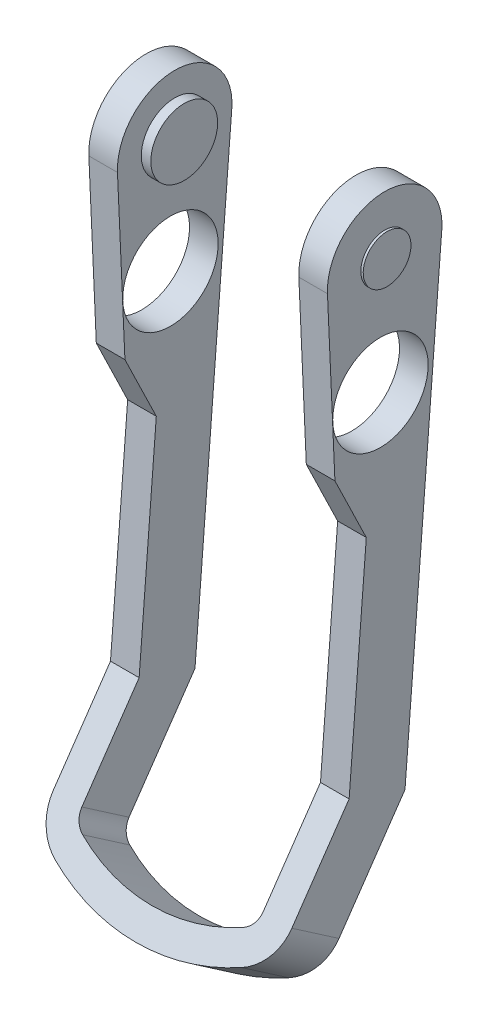
ISO-10303-21;
HEADER;
FILE_DESCRIPTION(('STEP AP214'),'2;1');
FILE_NAME('part.step','',(''),(''),'','','');
FILE_SCHEMA(('AUTOMOTIVE_DESIGN { 1 0 10303 214 1 1 1 1 }'));
ENDSEC;
DATA;
#1=APPLICATION_CONTEXT('core data for automotive mechanical design processes');
#2=APPLICATION_PROTOCOL_DEFINITION('international standard','automotive_design',2000,#1);
#3=PRODUCT_CONTEXT('',#1,'mechanical');
#4=PRODUCT('Part','Part','',(#3));
#5=PRODUCT_RELATED_PRODUCT_CATEGORY('part','',(#4));
#6=PRODUCT_DEFINITION_FORMATION('','',#4);
#7=PRODUCT_DEFINITION_CONTEXT('part definition',#1,'design');
#8=PRODUCT_DEFINITION('design','',#6,#7);
#9=PRODUCT_DEFINITION_SHAPE('','',#8);
#10=(LENGTH_UNIT() NAMED_UNIT(*) SI_UNIT(.MILLI.,.METRE.));
#11=(NAMED_UNIT(*) PLANE_ANGLE_UNIT() SI_UNIT($,.RADIAN.));
#12=(NAMED_UNIT(*) SI_UNIT($,.STERADIAN.) SOLID_ANGLE_UNIT());
#13=UNCERTAINTY_MEASURE_WITH_UNIT(LENGTH_MEASURE(1.E-05),#10,'distance_accuracy_value','');
#14=(GEOMETRIC_REPRESENTATION_CONTEXT(3) GLOBAL_UNCERTAINTY_ASSIGNED_CONTEXT((#13)) GLOBAL_UNIT_ASSIGNED_CONTEXT((#10,
#11,#12)) REPRESENTATION_CONTEXT('',''));
#15=CARTESIAN_POINT('',(0.,0.,0.));
#16=DIRECTION('',(0.,0.,1.));
#17=DIRECTION('',(1.,0.,0.));
#18=AXIS2_PLACEMENT_3D('',#15,#16,#17);
#19=CARTESIAN_POINT('',(8.5,-6.74999999999999,11.25));
#20=DIRECTION('',(-1.,0.,0.));
#21=DIRECTION('',(0.,-1.,0.));
#22=AXIS2_PLACEMENT_3D('',#19,#20,#21);
#23=PLANE('',#22);
#24=CARTESIAN_POINT('',(8.5,-6.74999999999999,11.25));
#25=DIRECTION('',(-1.,0.,0.));
#26=DIRECTION('',(0.,-1.,0.));
#27=AXIS2_PLACEMENT_3D('',#24,#25,#26);
#28=CIRCLE('',#27,3.5);
#29=CARTESIAN_POINT('',(8.5,-10.25,11.25));
#30=VERTEX_POINT('',#29);
#31=EDGE_CURVE('E460',#30,#30,#28,.F.);
#32=ORIENTED_EDGE('',*,*,#31,.F.);
#33=EDGE_LOOP('',(#32));
#34=FACE_BOUND('',#33,.T.);
#35=ADVANCED_FACE('F36',(#34),#23,.T.);
#36=CARTESIAN_POINT('',(-8.50000000000001,-6.74999999999999,11.25));
#37=DIRECTION('',(1.,0.,0.));
#38=DIRECTION('',(0.,1.,0.));
#39=AXIS2_PLACEMENT_3D('',#36,#37,#38);
#40=PLANE('',#39);
#41=CARTESIAN_POINT('',(-8.50000000000001,-6.74999999999999,11.25));
#42=DIRECTION('',(1.,0.,0.));
#43=DIRECTION('',(0.,1.,0.));
#44=AXIS2_PLACEMENT_3D('',#41,#42,#43);
#45=CIRCLE('',#44,3.5);
#46=CARTESIAN_POINT('',(-8.50000000000001,-3.24999999999999,11.25));
#47=VERTEX_POINT('',#46);
#48=EDGE_CURVE('E457',#47,#47,#45,.F.);
#49=ORIENTED_EDGE('',*,*,#48,.F.);
#50=EDGE_LOOP('',(#49));
#51=FACE_BOUND('',#50,.T.);
#52=ADVANCED_FACE('F585',(#51),#40,.T.);
#53=CARTESIAN_POINT('',(9.5,-6.74999999999999,11.25));
#54=DIRECTION('',(-1.,0.,0.));
#55=DIRECTION('',(0.,-1.,0.));
#56=AXIS2_PLACEMENT_3D('',#53,#54,#55);
#57=CYLINDRICAL_SURFACE('',#56,3.5);
#58=ORIENTED_EDGE('',*,*,#31,.T.);
#59=EDGE_LOOP('',(#58));
#60=FACE_BOUND('',#59,.T.);
#61=CARTESIAN_POINT('',(9.5,-6.74999999999999,11.25));
#62=DIRECTION('',(-1.,0.,0.));
#63=DIRECTION('',(0.,-1.,0.));
#64=AXIS2_PLACEMENT_3D('',#61,#62,#63);
#65=CIRCLE('',#64,3.5);
#66=CARTESIAN_POINT('',(9.5,-10.25,11.25));
#67=VERTEX_POINT('',#66);
#68=EDGE_CURVE('E359',#67,#67,#65,.F.);
#69=ORIENTED_EDGE('',*,*,#68,.F.);
#70=EDGE_LOOP('',(#69));
#71=FACE_BOUND('',#70,.T.);
#72=ADVANCED_FACE('F581',(#60,#71),#57,.T.);
#73=CARTESIAN_POINT('',(-9.50000000000001,-6.74999999999999,11.25));
#74=DIRECTION('',(1.,0.,0.));
#75=DIRECTION('',(0.,1.,0.));
#76=AXIS2_PLACEMENT_3D('',#73,#74,#75);
#77=CYLINDRICAL_SURFACE('',#76,3.5);
#78=ORIENTED_EDGE('',*,*,#48,.T.);
#79=EDGE_LOOP('',(#78));
#80=FACE_BOUND('',#79,.T.);
#81=CARTESIAN_POINT('',(-9.50000000000001,-6.74999999999999,11.25));
#82=DIRECTION('',(1.,0.,0.));
#83=DIRECTION('',(0.,1.,0.));
#84=AXIS2_PLACEMENT_3D('',#81,#82,#83);
#85=CIRCLE('',#84,3.5);
#86=CARTESIAN_POINT('',(-9.50000000000001,-3.24999999999999,11.25));
#87=VERTEX_POINT('',#86);
#88=EDGE_CURVE('E363',#87,#87,#85,.F.);
#89=ORIENTED_EDGE('',*,*,#88,.F.);
#90=EDGE_LOOP('',(#89));
#91=FACE_BOUND('',#90,.T.);
#92=ADVANCED_FACE('F577',(#80,#91),#77,.T.);
#93=CARTESIAN_POINT('',(9.50000000000001,-34.9901429155061,12.5355969445364));
#94=DIRECTION('',(-1.,0.,0.));
#95=DIRECTION('',(0.,-1.,0.));
#96=AXIS2_PLACEMENT_3D('',#93,#94,#95);
#97=PLANE('',#96);
#98=CARTESIAN_POINT('',(9.50000000000001,-18.7521667780927,11.6949636286788));
#99=DIRECTION('',(-1.,0.,0.));
#100=DIRECTION('',(0.,-1.,0.));
#101=AXIS2_PLACEMENT_3D('',#98,#99,#100);
#102=CIRCLE('',#101,5.);
#103=CARTESIAN_POINT('',(9.50000000000001,-23.7521667780927,11.6949636286788));
#104=VERTEX_POINT('',#103);
#105=EDGE_CURVE('E463',#104,#104,#102,.F.);
#106=ORIENTED_EDGE('',*,*,#105,.T.);
#107=EDGE_LOOP('',(#106));
#108=FACE_BOUND('',#107,.T.);
#109=ORIENTED_EDGE('',*,*,#68,.T.);
#110=EDGE_LOOP('',(#109));
#111=FACE_BOUND('',#110,.T.);
#112=DIRECTION('',(0.,0.996904814715934,-0.0786180030030606));
#113=VECTOR('',#112,1.);
#114=CARTESIAN_POINT('',(9.5,-56.0700439390991,9.12085325885437));
#115=LINE('',#114,#113);
#116=CARTESIAN_POINT('',(9.5,-56.0700439390991,9.12085325885437));
#117=VERTEX_POINT('',#116);
#118=CARTESIAN_POINT('',(9.50000000000001,-7.22170801801834,5.2685711117044));
#119=VERTEX_POINT('',#118);
#120=EDGE_CURVE('E244',#117,#119,#115,.T.);
#121=ORIENTED_EDGE('',*,*,#120,.F.);
#122=DIRECTION('',(0.,0.824035893197488,-0.566537595153418));
#123=VECTOR('',#122,1.);
#124=CARTESIAN_POINT('',(9.5,-71.7267259098514,19.8850675667693));
#125=LINE('',#124,#123);
#126=CARTESIAN_POINT('',(9.5,-66.12391112171,16.0330445634426));
#127=VERTEX_POINT('',#126);
#128=EDGE_CURVE('E228',#127,#117,#125,.T.);
#129=ORIENTED_EDGE('',*,*,#128,.F.);
#130=DIRECTION('',(0.,-0.566537595153414,-0.824035893197491));
#131=VECTOR('',#130,1.);
#132=CARTESIAN_POINT('',(9.49999999999997,-64.4242983362497,18.505152243035));
#133=LINE('',#132,#131);
#134=CARTESIAN_POINT('',(9.49999999999998,-62.7246855507895,20.9772599226275));
#135=VERTEX_POINT('',#134);
#136=EDGE_CURVE('E356',#135,#127,#133,.T.);
#137=ORIENTED_EDGE('',*,*,#136,.F.);
#138=DIRECTION('',(0.,-0.824035893197488,0.566537595153418));
#139=VECTOR('',#138,1.);
#140=CARTESIAN_POINT('',(9.5,-53.9956168808778,14.9758883646587));
#141=LINE('',#140,#139);
#142=CARTESIAN_POINT('',(9.5,-53.9956168808778,14.9758883646587));
#143=VERTEX_POINT('',#142);
#144=EDGE_CURVE('E282',#143,#135,#141,.T.);
#145=ORIENTED_EDGE('',*,*,#144,.F.);
#146=DIRECTION('',(0.,-0.996904814715934,0.0786180030030609));
#147=VECTOR('',#146,1.);
#148=CARTESIAN_POINT('',(9.50000000000001,-31.1741679605404,13.176141073575));
#149=LINE('',#148,#147);
#150=CARTESIAN_POINT('',(9.50000000000001,-31.1741679605404,13.176141073575));
#151=VERTEX_POINT('',#150);
#152=EDGE_CURVE('E269',#151,#143,#149,.T.);
#153=ORIENTED_EDGE('',*,*,#152,.F.);
#154=DIRECTION('',(0.,-0.899856747098899,-0.436185550770069));
#155=VECTOR('',#154,1.);
#156=CARTESIAN_POINT('',(9.50000000000001,-24.3948356448686,16.4622716821391));
#157=LINE('',#156,#155);
#158=CARTESIAN_POINT('',(9.5,-24.3948356448686,16.4622716821391));
#159=VERTEX_POINT('',#158);
#160=EDGE_CURVE('E258',#159,#151,#157,.T.);
#161=ORIENTED_EDGE('',*,*,#160,.F.);
#162=DIRECTION('',(0.,-0.998989596299085,-0.0449420347357742));
#163=VECTOR('',#162,1.);
#164=CARTESIAN_POINT('',(9.5,-7.01965220841463,17.2439375777945));
#165=LINE('',#164,#163);
#166=CARTESIAN_POINT('',(9.50000000000001,-7.01965220841463,17.2439375777945));
#167=VERTEX_POINT('',#166);
#168=EDGE_CURVE('E252',#167,#159,#165,.T.);
#169=ORIENTED_EDGE('',*,*,#168,.F.);
#170=CARTESIAN_POINT('',(9.50000000000001,-6.74999999999998,11.25));
#171=DIRECTION('',(-1.,0.,0.));
#172=DIRECTION('',(0.,-1.,0.));
#173=AXIS2_PLACEMENT_3D('',#170,#171,#172);
#174=CIRCLE('',#173,6.);
#175=EDGE_CURVE('E248',#119,#167,#174,.F.);
#176=ORIENTED_EDGE('',*,*,#175,.F.);
#177=EDGE_LOOP('',(#121,#129,#137,#145,#153,#161,#169,#176));
#178=FACE_BOUND('',#177,.T.);
#179=ADVANCED_FACE('F573',(#108,#111,#178),#97,.T.);
#180=CARTESIAN_POINT('',(7.5,-66.12391112171,16.0330445634426));
#181=DIRECTION('',(0.,0.566537595153404,0.824035893197498));
#182=DIRECTION('',(0.,-0.824035893197498,0.566537595153404));
#183=AXIS2_PLACEMENT_3D('',#180,#181,#182);
#184=CYLINDRICAL_SURFACE('',#183,1.99999999999997);
#185=CARTESIAN_POINT('',(7.50000000000002,-62.7246855507896,20.9772599226275));
#186=DIRECTION('',(0.,0.566537595153404,0.824035893197498));
#187=DIRECTION('',(0.,-0.824035893197498,0.566537595153404));
#188=AXIS2_PLACEMENT_3D('',#185,#186,#187);
#189=CIRCLE('',#188,1.99999999999997);
#190=CARTESIAN_POINT('',(8.40737240075621,-64.1933836876234,21.9870129167836));
#191=VERTEX_POINT('',#190);
#192=EDGE_CURVE('E294',#135,#191,#189,.F.);
#193=ORIENTED_EDGE('',*,*,#192,.F.);
#194=ORIENTED_EDGE('',*,*,#136,.T.);
#195=CARTESIAN_POINT('',(7.5,-66.12391112171,16.0330445634426));
#196=DIRECTION('',(0.,0.566537595153404,0.824035893197498));
#197=DIRECTION('',(0.,-0.824035893197498,0.566537595153404));
#198=AXIS2_PLACEMENT_3D('',#195,#196,#197);
#199=CIRCLE('',#198,1.99999999999997);
#200=CARTESIAN_POINT('',(8.40737240075632,-67.592609258544,17.0427975575987));
#201=VERTEX_POINT('',#200);
#202=EDGE_CURVE('E232',#201,#127,#199,.T.);
#203=ORIENTED_EDGE('',*,*,#202,.F.);
#204=DIRECTION('',(0.,-0.566537595153494,-0.824035893197436));
#205=VECTOR('',#204,1.);
#206=CARTESIAN_POINT('',(8.40737240075633,-65.8929964730827,19.5149052371928));
#207=LINE('',#206,#205);
#208=EDGE_CURVE('E358',#191,#201,#207,.T.);
#209=ORIENTED_EDGE('',*,*,#208,.F.);
#210=EDGE_LOOP('',(#193,#194,#203,#209));
#211=FACE_BOUND('',#210,.T.);
#212=ADVANCED_FACE('F570',(#211),#184,.F.);
#213=CARTESIAN_POINT('',(0.,-50.5849775135231,12.6310203303064));
#214=DIRECTION('',(0.,-0.566537595153469,-0.824035893197453));
#215=DIRECTION('',(0.,0.824035893197453,-0.566537595153469));
#216=AXIS2_PLACEMENT_3D('',#213,#214,#215);
#217=CYLINDRICAL_SURFACE('',#216,18.5312500000002);
#218=ORIENTED_EDGE('',*,*,#208,.T.);
#219=CARTESIAN_POINT('',(0.,-53.9842030844439,7.68680497112167));
#220=DIRECTION('',(0.,-0.566537595153469,-0.824035893197453));
#221=DIRECTION('',(0.,0.824035893197453,-0.566537595153469));
#222=AXIS2_PLACEMENT_3D('',#219,#220,#221);
#223=CIRCLE('',#222,18.5312500000002);
#224=CARTESIAN_POINT('',(-8.40737240075632,-67.5926092585442,17.0427975575987));
#225=VERTEX_POINT('',#224);
#226=EDGE_CURVE('E416',#225,#201,#223,.F.);
#227=ORIENTED_EDGE('',*,*,#226,.F.);
#228=DIRECTION('',(0.,-0.566537595153433,-0.824035893197478));
#229=VECTOR('',#228,1.);
#230=CARTESIAN_POINT('',(-8.40737240075635,-65.8929964730835,19.5149052371911));
#231=LINE('',#230,#229);
#232=CARTESIAN_POINT('',(-8.40737240075616,-64.1933836876232,21.9870129167835));
#233=VERTEX_POINT('',#232);
#234=EDGE_CURVE('E361',#233,#225,#231,.T.);
#235=ORIENTED_EDGE('',*,*,#234,.F.);
#236=CARTESIAN_POINT('',(0.,-50.5849775135231,12.6310203303064));
#237=DIRECTION('',(0.,-0.566537595153469,-0.824035893197453));
#238=DIRECTION('',(0.,0.824035893197453,-0.566537595153469));
#239=AXIS2_PLACEMENT_3D('',#236,#237,#238);
#240=CIRCLE('',#239,18.5312500000002);
#241=EDGE_CURVE('E439',#191,#233,#240,.T.);
#242=ORIENTED_EDGE('',*,*,#241,.F.);
#243=EDGE_LOOP('',(#218,#227,#235,#242));
#244=FACE_BOUND('',#243,.T.);
#245=ADVANCED_FACE('F443',(#244),#217,.F.);
#246=CARTESIAN_POINT('',(-7.5,-62.7246855507895,20.9772599226275));
#247=DIRECTION('',(0.,-0.566537595153519,-0.824035893197419));
#248=DIRECTION('',(0.,0.824035893197419,-0.566537595153519));
#249=AXIS2_PLACEMENT_3D('',#246,#247,#248);
#250=CYLINDRICAL_SURFACE('',#249,1.99999999999982);
#251=CARTESIAN_POINT('',(-7.49999999999999,-66.1239111217107,16.0330445634428));
#252=DIRECTION('',(0.,-0.566537595153519,-0.824035893197419));
#253=DIRECTION('',(0.,0.824035893197419,-0.566537595153519));
#254=AXIS2_PLACEMENT_3D('',#251,#252,#253);
#255=CIRCLE('',#254,1.99999999999982);
#256=CARTESIAN_POINT('',(-9.5,-66.1239111217104,16.0330445634427));
#257=VERTEX_POINT('',#256);
#258=EDGE_CURVE('E225',#257,#225,#255,.F.);
#259=ORIENTED_EDGE('',*,*,#258,.F.);
#260=DIRECTION('',(0.,-0.566537595153419,-0.824035893197487));
#261=VECTOR('',#260,1.);
#262=CARTESIAN_POINT('',(-9.5,-62.7246855507895,20.9772599226275));
#263=LINE('',#262,#261);
#264=CARTESIAN_POINT('',(-9.5,-62.7246855507895,20.9772599226275));
#265=VERTEX_POINT('',#264);
#266=EDGE_CURVE('E364',#265,#257,#263,.T.);
#267=ORIENTED_EDGE('',*,*,#266,.F.);
#268=CARTESIAN_POINT('',(-7.5,-62.7246855507895,20.9772599226275));
#269=DIRECTION('',(0.,-0.566537595153519,-0.824035893197419));
#270=DIRECTION('',(0.,0.824035893197419,-0.566537595153519));
#271=AXIS2_PLACEMENT_3D('',#268,#269,#270);
#272=CIRCLE('',#271,1.99999999999982);
#273=EDGE_CURVE('E299',#233,#265,#272,.T.);
#274=ORIENTED_EDGE('',*,*,#273,.F.);
#275=ORIENTED_EDGE('',*,*,#234,.T.);
#276=EDGE_LOOP('',(#259,#267,#274,#275));
#277=FACE_BOUND('',#276,.T.);
#278=ADVANCED_FACE('F412',(#277),#250,.F.);
#279=CARTESIAN_POINT('',(-9.5,-34.9901429155061,12.5355969445364));
#280=DIRECTION('',(1.,0.,0.));
#281=DIRECTION('',(0.,1.,0.));
#282=AXIS2_PLACEMENT_3D('',#279,#280,#281);
#283=PLANE('',#282);
#284=CARTESIAN_POINT('',(-9.49999999999999,-18.7521667780927,11.6949636286788));
#285=DIRECTION('',(1.,0.,0.));
#286=DIRECTION('',(0.,1.,0.));
#287=AXIS2_PLACEMENT_3D('',#284,#285,#286);
#288=CIRCLE('',#287,5.);
#289=CARTESIAN_POINT('',(-9.49999999999999,-13.7521667780927,11.6949636286788));
#290=VERTEX_POINT('',#289);
#291=EDGE_CURVE('E466',#290,#290,#288,.F.);
#292=ORIENTED_EDGE('',*,*,#291,.T.);
#293=EDGE_LOOP('',(#292));
#294=FACE_BOUND('',#293,.T.);
#295=ORIENTED_EDGE('',*,*,#88,.T.);
#296=EDGE_LOOP('',(#295));
#297=FACE_BOUND('',#296,.T.);
#298=DIRECTION('',(0.,-0.996904814715934,0.0786180030030609));
#299=VECTOR('',#298,1.);
#300=CARTESIAN_POINT('',(-9.50000000000001,-31.1741679605404,13.176141073575));
#301=LINE('',#300,#299);
#302=CARTESIAN_POINT('',(-9.5,-53.9956168808778,14.9758883646587));
#303=VERTEX_POINT('',#302);
#304=CARTESIAN_POINT('',(-9.50000000000001,-31.1741679605404,13.176141073575));
#305=VERTEX_POINT('',#304);
#306=EDGE_CURVE('E369',#303,#305,#301,.F.);
#307=ORIENTED_EDGE('',*,*,#306,.F.);
#308=DIRECTION('',(0.,-0.824035893197488,0.566537595153418));
#309=VECTOR('',#308,1.);
#310=CARTESIAN_POINT('',(-9.5,-53.9956168808778,14.9758883646587));
#311=LINE('',#310,#309);
#312=EDGE_CURVE('E297',#265,#303,#311,.F.);
#313=ORIENTED_EDGE('',*,*,#312,.F.);
#314=ORIENTED_EDGE('',*,*,#266,.T.);
#315=DIRECTION('',(0.,0.824035893197488,-0.566537595153418));
#316=VECTOR('',#315,1.);
#317=CARTESIAN_POINT('',(-9.5,-71.7267259098514,19.8850675667693));
#318=LINE('',#317,#316);
#319=CARTESIAN_POINT('',(-9.5,-56.0700439390991,9.12085325885436));
#320=VERTEX_POINT('',#319);
#321=EDGE_CURVE('E186',#320,#257,#318,.F.);
#322=ORIENTED_EDGE('',*,*,#321,.F.);
#323=DIRECTION('',(0.,0.996904814715934,-0.0786180030030606));
#324=VECTOR('',#323,1.);
#325=CARTESIAN_POINT('',(-9.50000000000001,-56.0700439390991,9.12085325885437));
#326=LINE('',#325,#324);
#327=CARTESIAN_POINT('',(-9.5,-7.22170801801835,5.2685711117044));
#328=VERTEX_POINT('',#327);
#329=EDGE_CURVE('E180',#328,#320,#326,.F.);
#330=ORIENTED_EDGE('',*,*,#329,.F.);
#331=CARTESIAN_POINT('',(-9.5,-6.74999999999998,11.25));
#332=DIRECTION('',(-1.,0.,0.));
#333=DIRECTION('',(0.,-1.,0.));
#334=AXIS2_PLACEMENT_3D('',#331,#332,#333);
#335=CIRCLE('',#334,6.);
#336=CARTESIAN_POINT('',(-9.5,-7.01965220841463,17.2439375777945));
#337=VERTEX_POINT('',#336);
#338=EDGE_CURVE('E183',#337,#328,#335,.T.);
#339=ORIENTED_EDGE('',*,*,#338,.F.);
#340=DIRECTION('',(0.,-0.998989596299085,-0.0449420347357742));
#341=VECTOR('',#340,1.);
#342=CARTESIAN_POINT('',(-9.50000000000001,-7.01965220841463,17.2439375777945));
#343=LINE('',#342,#341);
#344=CARTESIAN_POINT('',(-9.50000000000001,-24.3948356448686,16.4622716821391));
#345=VERTEX_POINT('',#344);
#346=EDGE_CURVE('E334',#345,#337,#343,.F.);
#347=ORIENTED_EDGE('',*,*,#346,.F.);
#348=DIRECTION('',(0.,-0.899856747098899,-0.436185550770069));
#349=VECTOR('',#348,1.);
#350=CARTESIAN_POINT('',(-9.50000000000001,-24.3948356448686,16.4622716821391));
#351=LINE('',#350,#349);
#352=EDGE_CURVE('E327',#305,#345,#351,.F.);
#353=ORIENTED_EDGE('',*,*,#352,.F.);
#354=EDGE_LOOP('',(#307,#313,#314,#322,#330,#339,#347,#353));
#355=FACE_BOUND('',#354,.T.);
#356=ADVANCED_FACE('F182',(#294,#297,#355),#283,.T.);
#357=CARTESIAN_POINT('',(0.,-50.5849775135225,12.6310203303072));
#358=DIRECTION('',(0.,-0.566537595153418,-0.824035893197488));
#359=DIRECTION('',(0.,0.824035893197488,-0.566537595153418));
#360=AXIS2_PLACEMENT_3D('',#357,#358,#359);
#361=CYLINDRICAL_SURFACE('',#360,21.53125);
#362=DIRECTION('',(0.,0.566537595153419,0.824035893197487));
#363=VECTOR('',#362,1.);
#364=CARTESIAN_POINT('',(-9.76843100189039,-66.396430892874,23.5016424080174));
#365=LINE('',#364,#363);
#366=CARTESIAN_POINT('',(-9.76843100189038,-69.7956564637945,18.5574270488325));
#367=VERTEX_POINT('',#366);
#368=CARTESIAN_POINT('',(-9.76843100189038,-66.396430892874,23.5016424080174));
#369=VERTEX_POINT('',#368);
#370=EDGE_CURVE('E366',#367,#369,#365,.T.);
#371=ORIENTED_EDGE('',*,*,#370,.F.);
#372=CARTESIAN_POINT('',(0.,-53.984203084443,7.68680497112229));
#373=DIRECTION('',(0.,-0.566537595153418,-0.824035893197488));
#374=DIRECTION('',(0.,0.824035893197488,-0.566537595153418));
#375=AXIS2_PLACEMENT_3D('',#372,#373,#374);
#376=CIRCLE('',#375,21.53125);
#377=CARTESIAN_POINT('',(9.76843100189036,-69.7956564637946,18.5574270488324));
#378=VERTEX_POINT('',#377);
#379=EDGE_CURVE('E449',#378,#367,#376,.T.);
#380=ORIENTED_EDGE('',*,*,#379,.F.);
#381=DIRECTION('',(0.,-0.566537595153419,-0.824035893197487));
#382=VECTOR('',#381,1.);
#383=CARTESIAN_POINT('',(9.76843100189036,-66.396430892874,23.5016424080174));
#384=LINE('',#383,#382);
#385=CARTESIAN_POINT('',(9.76843100189036,-66.396430892874,23.5016424080174));
#386=VERTEX_POINT('',#385);
#387=EDGE_CURVE('E190',#386,#378,#384,.T.);
#388=ORIENTED_EDGE('',*,*,#387,.F.);
#389=CARTESIAN_POINT('',(0.,-50.5849775135225,12.6310203303073));
#390=DIRECTION('',(0.,-0.566537595153418,-0.824035893197488));
#391=DIRECTION('',(0.,0.824035893197488,-0.566537595153418));
#392=AXIS2_PLACEMENT_3D('',#389,#390,#391);
#393=CIRCLE('',#392,21.53125);
#394=CARTESIAN_POINT('',(0.,-68.3275003389309,24.8292829259543));
#395=VERTEX_POINT('',#394);
#396=EDGE_CURVE('E53',#395,#386,#393,.F.);
#397=ORIENTED_EDGE('',*,*,#396,.F.);
#398=EDGE_CURVE('E426',#369,#395,#393,.F.);
#399=ORIENTED_EDGE('',*,*,#398,.F.);
#400=EDGE_LOOP('',(#371,#380,#388,#397,#399));
#401=FACE_BOUND('',#400,.T.);
#402=ADVANCED_FACE('F560',(#401),#361,.T.);
#403=CARTESIAN_POINT('',(-7.5,-62.7246855507895,20.9772599226275));
#404=DIRECTION('',(0.,0.566537595153419,0.824035893197487));
#405=DIRECTION('',(0.,-0.824035893197487,0.566537595153419));
#406=AXIS2_PLACEMENT_3D('',#403,#404,#405);
#407=CYLINDRICAL_SURFACE('',#406,5.);
#408=CARTESIAN_POINT('',(-7.50000000000001,-66.12391112171,16.0330445634426));
#409=DIRECTION('',(0.,0.566537595153419,0.824035893197487));
#410=DIRECTION('',(0.,-0.824035893197487,0.566537595153419));
#411=AXIS2_PLACEMENT_3D('',#408,#409,#410);
#412=CIRCLE('',#411,5.);
#413=CARTESIAN_POINT('',(-12.5,-66.12391112171,16.0330445634426));
#414=VERTEX_POINT('',#413);
#415=EDGE_CURVE('E212',#367,#414,#412,.F.);
#416=ORIENTED_EDGE('',*,*,#415,.F.);
#417=ORIENTED_EDGE('',*,*,#370,.T.);
#418=CARTESIAN_POINT('',(-7.5,-62.7246855507895,20.9772599226275));
#419=DIRECTION('',(0.,0.566537595153419,0.824035893197487));
#420=DIRECTION('',(0.,-0.824035893197487,0.566537595153419));
#421=AXIS2_PLACEMENT_3D('',#418,#419,#420);
#422=CIRCLE('',#421,5.);
#423=CARTESIAN_POINT('',(-12.5,-62.7246855507895,20.9772599226275));
#424=VERTEX_POINT('',#423);
#425=EDGE_CURVE('E355',#424,#369,#422,.T.);
#426=ORIENTED_EDGE('',*,*,#425,.F.);
#427=DIRECTION('',(0.,0.566537595153419,0.824035893197487));
#428=VECTOR('',#427,1.);
#429=CARTESIAN_POINT('',(-12.5,-66.12391112171,16.0330445634426));
#430=LINE('',#429,#428);
#431=EDGE_CURVE('E218',#414,#424,#430,.T.);
#432=ORIENTED_EDGE('',*,*,#431,.F.);
#433=EDGE_LOOP('',(#416,#417,#426,#432));
#434=FACE_BOUND('',#433,.T.);
#435=ADVANCED_FACE('F557',(#434),#407,.T.);
#436=CARTESIAN_POINT('',(12.5,-31.1741679605404,13.176141073575));
#437=DIRECTION('',(0.,0.0786180030030609,0.996904814715934));
#438=DIRECTION('',(0.,-0.996904814715934,0.0786180030030609));
#439=AXIS2_PLACEMENT_3D('',#436,#437,#438);
#440=PLANE('',#439);
#441=DIRECTION('',(0.,0.996904814715934,-0.0786180030030615));
#442=VECTOR('',#441,1.);
#443=CARTESIAN_POINT('',(-12.5,-53.9956168808778,14.9758883646587));
#444=LINE('',#443,#442);
#445=CARTESIAN_POINT('',(-12.5,-53.9956168808778,14.9758883646587));
#446=VERTEX_POINT('',#445);
#447=CARTESIAN_POINT('',(-12.5,-31.1741679605404,13.176141073575));
#448=VERTEX_POINT('',#447);
#449=EDGE_CURVE('E380',#446,#448,#444,.T.);
#450=ORIENTED_EDGE('',*,*,#449,.F.);
#451=DIRECTION('',(1.,0.,0.));
#452=VECTOR('',#451,1.);
#453=CARTESIAN_POINT('',(12.5,-53.9956168808778,14.9758883646587));
#454=LINE('',#453,#452);
#455=EDGE_CURVE('E61',#303,#446,#454,.F.);
#456=ORIENTED_EDGE('',*,*,#455,.F.);
#457=ORIENTED_EDGE('',*,*,#306,.T.);
#458=DIRECTION('',(1.,0.,0.));
#459=VECTOR('',#458,1.);
#460=CARTESIAN_POINT('',(12.5,-31.1741679605404,13.176141073575));
#461=LINE('',#460,#459);
#462=EDGE_CURVE('E331',#448,#305,#461,.T.);
#463=ORIENTED_EDGE('',*,*,#462,.F.);
#464=EDGE_LOOP('',(#450,#456,#457,#463));
#465=FACE_BOUND('',#464,.T.);
#466=ADVANCED_FACE('F403',(#465),#440,.T.);
#467=CARTESIAN_POINT('',(12.5,-24.3948356448686,16.4622716821391));
#468=DIRECTION('',(0.,-0.436185550770069,0.899856747098899));
#469=DIRECTION('',(0.,-0.899856747098899,-0.436185550770069));
#470=AXIS2_PLACEMENT_3D('',#467,#468,#469);
#471=PLANE('',#470);
#472=DIRECTION('',(0.,0.8998567470989,0.436185550770067));
#473=VECTOR('',#472,1.);
#474=CARTESIAN_POINT('',(-12.5,-31.1741679605404,13.176141073575));
#475=LINE('',#474,#473);
#476=CARTESIAN_POINT('',(-12.5,-24.3948356448686,16.4622716821391));
#477=VERTEX_POINT('',#476);
#478=EDGE_CURVE('E305',#448,#477,#475,.T.);
#479=ORIENTED_EDGE('',*,*,#478,.F.);
#480=ORIENTED_EDGE('',*,*,#462,.T.);
#481=ORIENTED_EDGE('',*,*,#352,.T.);
#482=DIRECTION('',(1.,0.,0.));
#483=VECTOR('',#482,1.);
#484=CARTESIAN_POINT('',(12.5,-24.3948356448686,16.4622716821391));
#485=LINE('',#484,#483);
#486=EDGE_CURVE('E330',#477,#345,#485,.T.);
#487=ORIENTED_EDGE('',*,*,#486,.F.);
#488=EDGE_LOOP('',(#479,#480,#481,#487));
#489=FACE_BOUND('',#488,.T.);
#490=ADVANCED_FACE('F400',(#489),#471,.T.);
#491=CARTESIAN_POINT('',(12.5,-7.01965220841463,17.2439375777945));
#492=DIRECTION('',(0.,-0.0449420347357742,0.998989596299085));
#493=DIRECTION('',(0.,-0.998989596299085,-0.0449420347357742));
#494=AXIS2_PLACEMENT_3D('',#491,#492,#493);
#495=PLANE('',#494);
#496=DIRECTION('',(0.,0.998989596299085,0.0449420347357736));
#497=VECTOR('',#496,1.);
#498=CARTESIAN_POINT('',(-12.5,-24.3948356448686,16.4622716821391));
#499=LINE('',#498,#497);
#500=CARTESIAN_POINT('',(-12.5,-7.01965220841462,17.2439375777945));
#501=VERTEX_POINT('',#500);
#502=EDGE_CURVE('E302',#477,#501,#499,.T.);
#503=ORIENTED_EDGE('',*,*,#502,.F.);
#504=ORIENTED_EDGE('',*,*,#486,.T.);
#505=ORIENTED_EDGE('',*,*,#346,.T.);
#506=DIRECTION('',(-1.,0.,0.));
#507=VECTOR('',#506,1.);
#508=CARTESIAN_POINT('',(12.5,-7.01965220841463,17.2439375777945));
#509=LINE('',#508,#507);
#510=EDGE_CURVE('E198',#501,#337,#509,.F.);
#511=ORIENTED_EDGE('',*,*,#510,.F.);
#512=EDGE_LOOP('',(#503,#504,#505,#511));
#513=FACE_BOUND('',#512,.T.);
#514=ADVANCED_FACE('F397',(#513),#495,.T.);
#515=CARTESIAN_POINT('',(12.5,-6.74999999999998,11.25));
#516=DIRECTION('',(-1.,0.,0.));
#517=DIRECTION('',(0.,-1.,0.));
#518=AXIS2_PLACEMENT_3D('',#515,#516,#517);
#519=CYLINDRICAL_SURFACE('',#518,6.);
#520=CARTESIAN_POINT('',(-12.5,-6.74999999999998,11.25));
#521=DIRECTION('',(-1.,0.,0.));
#522=DIRECTION('',(0.,-1.,0.));
#523=AXIS2_PLACEMENT_3D('',#520,#521,#522);
#524=CIRCLE('',#523,6.);
#525=CARTESIAN_POINT('',(-12.5,-7.22170801801834,5.2685711117044));
#526=VERTEX_POINT('',#525);
#527=EDGE_CURVE('E276',#501,#526,#524,.T.);
#528=ORIENTED_EDGE('',*,*,#527,.F.);
#529=ORIENTED_EDGE('',*,*,#510,.T.);
#530=ORIENTED_EDGE('',*,*,#338,.T.);
#531=DIRECTION('',(1.,0.,0.));
#532=VECTOR('',#531,1.);
#533=CARTESIAN_POINT('',(12.5,-7.22170801801834,5.2685711117044));
#534=LINE('',#533,#532);
#535=EDGE_CURVE('E191',#526,#328,#534,.T.);
#536=ORIENTED_EDGE('',*,*,#535,.F.);
#537=EDGE_LOOP('',(#528,#529,#530,#536));
#538=FACE_BOUND('',#537,.T.);
#539=ADVANCED_FACE('F196',(#538),#519,.T.);
#540=CARTESIAN_POINT('',(12.5,-56.0700439390991,9.12085325885437));
#541=DIRECTION('',(0.,-0.0786180030030606,-0.996904814715934));
#542=DIRECTION('',(0.,0.996904814715934,-0.0786180030030606));
#543=AXIS2_PLACEMENT_3D('',#540,#541,#542);
#544=PLANE('',#543);
#545=DIRECTION('',(0.,-0.996904814715934,0.0786180030030606));
#546=VECTOR('',#545,1.);
#547=CARTESIAN_POINT('',(-12.5,-7.22170801801835,5.2685711117044));
#548=LINE('',#547,#546);
#549=CARTESIAN_POINT('',(-12.5,-56.0700439390991,9.12085325885437));
#550=VERTEX_POINT('',#549);
#551=EDGE_CURVE('E202',#526,#550,#548,.T.);
#552=ORIENTED_EDGE('',*,*,#551,.F.);
#553=ORIENTED_EDGE('',*,*,#535,.T.);
#554=ORIENTED_EDGE('',*,*,#329,.T.);
#555=DIRECTION('',(1.,0.,0.));
#556=VECTOR('',#555,1.);
#557=CARTESIAN_POINT('',(12.5,-56.0700439390991,9.12085325885436));
#558=LINE('',#557,#556);
#559=EDGE_CURVE('E210',#550,#320,#558,.T.);
#560=ORIENTED_EDGE('',*,*,#559,.F.);
#561=EDGE_LOOP('',(#552,#553,#554,#560));
#562=FACE_BOUND('',#561,.T.);
#563=ADVANCED_FACE('F200',(#562),#544,.T.);
#564=CARTESIAN_POINT('',(7.49999999999999,-62.7246855507895,20.9772599226275));
#565=DIRECTION('',(0.,-0.566537595153419,-0.824035893197487));
#566=DIRECTION('',(0.,0.824035893197487,-0.566537595153419));
#567=AXIS2_PLACEMENT_3D('',#564,#565,#566);
#568=CYLINDRICAL_SURFACE('',#567,5.);
#569=CARTESIAN_POINT('',(7.49999999999999,-62.7246855507895,20.9772599226275));
#570=DIRECTION('',(0.,-0.566537595153419,-0.824035893197487));
#571=DIRECTION('',(0.,0.824035893197487,-0.566537595153419));
#572=AXIS2_PLACEMENT_3D('',#569,#570,#571);
#573=CIRCLE('',#572,5.);
#574=CARTESIAN_POINT('',(12.5,-62.7246855507895,20.9772599226275));
#575=VERTEX_POINT('',#574);
#576=EDGE_CURVE('E283',#386,#575,#573,.F.);
#577=ORIENTED_EDGE('',*,*,#576,.F.);
#578=ORIENTED_EDGE('',*,*,#387,.T.);
#579=CARTESIAN_POINT('',(7.5,-66.12391112171,16.0330445634426));
#580=DIRECTION('',(0.,-0.566537595153419,-0.824035893197487));
#581=DIRECTION('',(0.,0.824035893197487,-0.566537595153419));
#582=AXIS2_PLACEMENT_3D('',#579,#580,#581);
#583=CIRCLE('',#582,5.);
#584=CARTESIAN_POINT('',(12.5,-66.12391112171,16.0330445634426));
#585=VERTEX_POINT('',#584);
#586=EDGE_CURVE('E351',#585,#378,#583,.T.);
#587=ORIENTED_EDGE('',*,*,#586,.F.);
#588=DIRECTION('',(0.,-0.566537595153419,-0.824035893197487));
#589=VECTOR('',#588,1.);
#590=CARTESIAN_POINT('',(12.5,-62.7246855507895,20.9772599226275));
#591=LINE('',#590,#589);
#592=EDGE_CURVE('E239',#575,#585,#591,.T.);
#593=ORIENTED_EDGE('',*,*,#592,.F.);
#594=EDGE_LOOP('',(#577,#578,#587,#593));
#595=FACE_BOUND('',#594,.T.);
#596=ADVANCED_FACE('F543',(#595),#568,.T.);
#597=CARTESIAN_POINT('',(12.5,-71.7267259098514,19.8850675667693));
#598=DIRECTION('',(0.,-0.566537595153418,-0.824035893197488));
#599=DIRECTION('',(0.,0.824035893197488,-0.566537595153418));
#600=AXIS2_PLACEMENT_3D('',#597,#598,#599);
#601=PLANE('',#600);
#602=DIRECTION('',(1.,0.,0.));
#603=VECTOR('',#602,1.);
#604=CARTESIAN_POINT('',(12.5,-56.0700439390991,9.12085325885437));
#605=LINE('',#604,#603);
#606=CARTESIAN_POINT('',(12.5,-56.0700439390991,9.12085325885437));
#607=VERTEX_POINT('',#606);
#608=EDGE_CURVE('E231',#607,#117,#605,.F.);
#609=ORIENTED_EDGE('',*,*,#608,.F.);
#610=DIRECTION('',(0.,0.824035893197487,-0.56653759515342));
#611=VECTOR('',#610,1.);
#612=CARTESIAN_POINT('',(12.5,-66.12391112171,16.0330445634426));
#613=LINE('',#612,#611);
#614=EDGE_CURVE('E235',#585,#607,#613,.T.);
#615=ORIENTED_EDGE('',*,*,#614,.F.);
#616=ORIENTED_EDGE('',*,*,#586,.T.);
#617=ORIENTED_EDGE('',*,*,#379,.T.);
#618=ORIENTED_EDGE('',*,*,#415,.T.);
#619=DIRECTION('',(0.,-0.824035893197487,0.56653759515342));
#620=VECTOR('',#619,1.);
#621=CARTESIAN_POINT('',(-12.5,-56.0700439390991,9.12085325885437));
#622=LINE('',#621,#620);
#623=EDGE_CURVE('E215',#550,#414,#622,.T.);
#624=ORIENTED_EDGE('',*,*,#623,.F.);
#625=ORIENTED_EDGE('',*,*,#559,.T.);
#626=ORIENTED_EDGE('',*,*,#321,.T.);
#627=ORIENTED_EDGE('',*,*,#258,.T.);
#628=ORIENTED_EDGE('',*,*,#226,.T.);
#629=ORIENTED_EDGE('',*,*,#202,.T.);
#630=ORIENTED_EDGE('',*,*,#128,.T.);
#631=EDGE_LOOP('',(#609,#615,#616,#617,#618,#624,#625,#626,#627,#628,#629,#630));
#632=FACE_BOUND('',#631,.T.);
#633=ADVANCED_FACE('F418',(#632),#601,.T.);
#634=CARTESIAN_POINT('',(12.5,-56.0700439390991,9.12085325885437));
#635=DIRECTION('',(0.,-0.0786180030030606,-0.996904814715934));
#636=DIRECTION('',(0.,0.996904814715934,-0.0786180030030606));
#637=AXIS2_PLACEMENT_3D('',#634,#635,#636);
#638=PLANE('',#637);
#639=DIRECTION('',(0.,0.996904814715934,-0.0786180030030606));
#640=VECTOR('',#639,1.);
#641=CARTESIAN_POINT('',(12.5,-56.0700439390991,9.12085325885437));
#642=LINE('',#641,#640);
#643=CARTESIAN_POINT('',(12.5,-7.22170801801834,5.2685711117044));
#644=VERTEX_POINT('',#643);
#645=EDGE_CURVE('E238',#607,#644,#642,.T.);
#646=ORIENTED_EDGE('',*,*,#645,.F.);
#647=ORIENTED_EDGE('',*,*,#608,.T.);
#648=ORIENTED_EDGE('',*,*,#120,.T.);
#649=DIRECTION('',(-1.,0.,0.));
#650=VECTOR('',#649,1.);
#651=CARTESIAN_POINT('',(12.5,-7.22170801801834,5.26857111170439));
#652=LINE('',#651,#650);
#653=EDGE_CURVE('E245',#644,#119,#652,.T.);
#654=ORIENTED_EDGE('',*,*,#653,.F.);
#655=EDGE_LOOP('',(#646,#647,#648,#654));
#656=FACE_BOUND('',#655,.T.);
#657=ADVANCED_FACE('F536',(#656),#638,.T.);
#658=CARTESIAN_POINT('',(12.5,-6.74999999999998,11.25));
#659=DIRECTION('',(-1.,0.,0.));
#660=DIRECTION('',(0.,-1.,0.));
#661=AXIS2_PLACEMENT_3D('',#658,#659,#660);
#662=CYLINDRICAL_SURFACE('',#661,6.);
#663=CARTESIAN_POINT('',(12.5,-6.74999999999998,11.25));
#664=DIRECTION('',(-1.,0.,0.));
#665=DIRECTION('',(0.,-1.,0.));
#666=AXIS2_PLACEMENT_3D('',#663,#664,#665);
#667=CIRCLE('',#666,6.);
#668=CARTESIAN_POINT('',(12.5,-7.01965220841462,17.2439375777945));
#669=VERTEX_POINT('',#668);
#670=EDGE_CURVE('E312',#644,#669,#667,.F.);
#671=ORIENTED_EDGE('',*,*,#670,.F.);
#672=ORIENTED_EDGE('',*,*,#653,.T.);
#673=ORIENTED_EDGE('',*,*,#175,.T.);
#674=DIRECTION('',(1.,0.,0.));
#675=VECTOR('',#674,1.);
#676=CARTESIAN_POINT('',(12.5,-7.01965220841463,17.2439375777945));
#677=LINE('',#676,#675);
#678=EDGE_CURVE('E249',#669,#167,#677,.F.);
#679=ORIENTED_EDGE('',*,*,#678,.F.);
#680=EDGE_LOOP('',(#671,#672,#673,#679));
#681=FACE_BOUND('',#680,.T.);
#682=ADVANCED_FACE('F532',(#681),#662,.T.);
#683=CARTESIAN_POINT('',(12.5,-7.01965220841463,17.2439375777945));
#684=DIRECTION('',(0.,-0.0449420347357742,0.998989596299085));
#685=DIRECTION('',(0.,-0.998989596299085,-0.0449420347357742));
#686=AXIS2_PLACEMENT_3D('',#683,#684,#685);
#687=PLANE('',#686);
#688=DIRECTION('',(0.,-0.998989596299085,-0.0449420347357736));
#689=VECTOR('',#688,1.);
#690=CARTESIAN_POINT('',(12.5,-7.01965220841463,17.2439375777945));
#691=LINE('',#690,#689);
#692=CARTESIAN_POINT('',(12.5,-24.3948356448686,16.4622716821391));
#693=VERTEX_POINT('',#692);
#694=EDGE_CURVE('E40',#669,#693,#691,.T.);
#695=ORIENTED_EDGE('',*,*,#694,.F.);
#696=ORIENTED_EDGE('',*,*,#678,.T.);
#697=ORIENTED_EDGE('',*,*,#168,.T.);
#698=DIRECTION('',(1.,0.,0.));
#699=VECTOR('',#698,1.);
#700=CARTESIAN_POINT('',(12.5,-24.3948356448686,16.4622716821391));
#701=LINE('',#700,#699);
#702=EDGE_CURVE('E255',#693,#159,#701,.F.);
#703=ORIENTED_EDGE('',*,*,#702,.F.);
#704=EDGE_LOOP('',(#695,#696,#697,#703));
#705=FACE_BOUND('',#704,.T.);
#706=ADVANCED_FACE('F528',(#705),#687,.T.);
#707=CARTESIAN_POINT('',(12.5,-24.3948356448686,16.4622716821391));
#708=DIRECTION('',(0.,-0.436185550770069,0.899856747098899));
#709=DIRECTION('',(0.,-0.899856747098899,-0.436185550770069));
#710=AXIS2_PLACEMENT_3D('',#707,#708,#709);
#711=PLANE('',#710);
#712=DIRECTION('',(0.,-0.8998567470989,-0.436185550770067));
#713=VECTOR('',#712,1.);
#714=CARTESIAN_POINT('',(12.5,-24.3948356448686,16.4622716821391));
#715=LINE('',#714,#713);
#716=CARTESIAN_POINT('',(12.5,-31.1741679605404,13.176141073575));
#717=VERTEX_POINT('',#716);
#718=EDGE_CURVE('E261',#693,#717,#715,.T.);
#719=ORIENTED_EDGE('',*,*,#718,.F.);
#720=ORIENTED_EDGE('',*,*,#702,.T.);
#721=ORIENTED_EDGE('',*,*,#160,.T.);
#722=DIRECTION('',(1.,0.,0.));
#723=VECTOR('',#722,1.);
#724=CARTESIAN_POINT('',(12.5,-31.1741679605404,13.176141073575));
#725=LINE('',#724,#723);
#726=EDGE_CURVE('E266',#717,#151,#725,.F.);
#727=ORIENTED_EDGE('',*,*,#726,.F.);
#728=EDGE_LOOP('',(#719,#720,#721,#727));
#729=FACE_BOUND('',#728,.T.);
#730=ADVANCED_FACE('F524',(#729),#711,.T.);
#731=CARTESIAN_POINT('',(12.5,-31.1741679605404,13.176141073575));
#732=DIRECTION('',(0.,0.0786180030030609,0.996904814715934));
#733=DIRECTION('',(0.,-0.996904814715934,0.0786180030030609));
#734=AXIS2_PLACEMENT_3D('',#731,#732,#733);
#735=PLANE('',#734);
#736=DIRECTION('',(0.,-0.996904814715934,0.0786180030030615));
#737=VECTOR('',#736,1.);
#738=CARTESIAN_POINT('',(12.5,-31.1741679605404,13.176141073575));
#739=LINE('',#738,#737);
#740=CARTESIAN_POINT('',(12.5,-53.9956168808778,14.9758883646587));
#741=VERTEX_POINT('',#740);
#742=EDGE_CURVE('E272',#717,#741,#739,.T.);
#743=ORIENTED_EDGE('',*,*,#742,.F.);
#744=ORIENTED_EDGE('',*,*,#726,.T.);
#745=ORIENTED_EDGE('',*,*,#152,.T.);
#746=DIRECTION('',(1.,0.,0.));
#747=VECTOR('',#746,1.);
#748=CARTESIAN_POINT('',(12.5,-53.9956168808778,14.9758883646587));
#749=LINE('',#748,#747);
#750=EDGE_CURVE('E279',#741,#143,#749,.F.);
#751=ORIENTED_EDGE('',*,*,#750,.F.);
#752=EDGE_LOOP('',(#743,#744,#745,#751));
#753=FACE_BOUND('',#752,.T.);
#754=ADVANCED_FACE('F521',(#753),#735,.T.);
#755=CARTESIAN_POINT('',(12.5,-53.9956168808778,14.9758883646587));
#756=DIRECTION('',(0.,0.566537595153418,0.824035893197488));
#757=DIRECTION('',(0.,-0.824035893197488,0.566537595153418));
#758=AXIS2_PLACEMENT_3D('',#755,#756,#757);
#759=PLANE('',#758);
#760=ORIENTED_EDGE('',*,*,#425,.T.);
#761=ORIENTED_EDGE('',*,*,#398,.T.);
#762=ORIENTED_EDGE('',*,*,#396,.T.);
#763=ORIENTED_EDGE('',*,*,#576,.T.);
#764=DIRECTION('',(0.,-0.824035893197488,0.566537595153418));
#765=VECTOR('',#764,1.);
#766=CARTESIAN_POINT('',(12.5,-53.9956168808778,14.9758883646587));
#767=LINE('',#766,#765);
#768=EDGE_CURVE('E275',#741,#575,#767,.T.);
#769=ORIENTED_EDGE('',*,*,#768,.F.);
#770=ORIENTED_EDGE('',*,*,#750,.T.);
#771=ORIENTED_EDGE('',*,*,#144,.T.);
#772=ORIENTED_EDGE('',*,*,#192,.T.);
#773=ORIENTED_EDGE('',*,*,#241,.T.);
#774=ORIENTED_EDGE('',*,*,#273,.T.);
#775=ORIENTED_EDGE('',*,*,#312,.T.);
#776=ORIENTED_EDGE('',*,*,#455,.T.);
#777=DIRECTION('',(0.,0.824035893197488,-0.566537595153418));
#778=VECTOR('',#777,1.);
#779=CARTESIAN_POINT('',(-12.5,-62.7246855507895,20.9772599226275));
#780=LINE('',#779,#778);
#781=EDGE_CURVE('E221',#424,#446,#780,.T.);
#782=ORIENTED_EDGE('',*,*,#781,.F.);
#783=EDGE_LOOP('',(#760,#761,#762,#763,#769,#770,#771,#772,#773,#774,#775,#776,#782));
#784=FACE_BOUND('',#783,.T.);
#785=ADVANCED_FACE('F406',(#784),#759,.T.);
#786=CARTESIAN_POINT('',(-12.5,-18.7667561910362,10.6950700598276));
#787=DIRECTION('',(-1.,0.,0.));
#788=DIRECTION('',(0.,-1.,0.));
#789=AXIS2_PLACEMENT_3D('',#786,#787,#788);
#790=PLANE('',#789);
#791=CARTESIAN_POINT('',(-12.5,-18.7521667780927,11.6949636286788));
#792=DIRECTION('',(-1.,0.,0.));
#793=DIRECTION('',(0.,-1.,0.));
#794=AXIS2_PLACEMENT_3D('',#791,#792,#793);
#795=CIRCLE('',#794,5.);
#796=CARTESIAN_POINT('',(-12.5,-23.7521667780927,11.6949636286788));
#797=VERTEX_POINT('',#796);
#798=EDGE_CURVE('E472',#797,#797,#795,.F.);
#799=ORIENTED_EDGE('',*,*,#798,.T.);
#800=EDGE_LOOP('',(#799));
#801=FACE_BOUND('',#800,.T.);
#802=ORIENTED_EDGE('',*,*,#551,.T.);
#803=ORIENTED_EDGE('',*,*,#623,.T.);
#804=ORIENTED_EDGE('',*,*,#431,.T.);
#805=ORIENTED_EDGE('',*,*,#781,.T.);
#806=ORIENTED_EDGE('',*,*,#449,.T.);
#807=ORIENTED_EDGE('',*,*,#478,.T.);
#808=ORIENTED_EDGE('',*,*,#502,.T.);
#809=ORIENTED_EDGE('',*,*,#527,.T.);
#810=EDGE_LOOP('',(#802,#803,#804,#805,#806,#807,#808,#809));
#811=FACE_BOUND('',#810,.T.);
#812=CARTESIAN_POINT('',(-12.5,-6.74999999999999,11.25));
#813=DIRECTION('',(-1.,0.,0.));
#814=DIRECTION('',(0.,-1.,0.));
#815=AXIS2_PLACEMENT_3D('',#812,#813,#814);
#816=CIRCLE('',#815,2.5);
#817=CARTESIAN_POINT('',(-12.5,-9.24999999999999,11.25));
#818=VERTEX_POINT('',#817);
#819=EDGE_CURVE('E45',#818,#818,#816,.T.);
#820=ORIENTED_EDGE('',*,*,#819,.F.);
#821=EDGE_LOOP('',(#820));
#822=FACE_BOUND('',#821,.T.);
#823=ADVANCED_FACE('F424',(#801,#811,#822),#790,.T.);
#824=CARTESIAN_POINT('',(12.5,-18.7667561910362,10.6950700598276));
#825=DIRECTION('',(1.,0.,0.));
#826=DIRECTION('',(0.,1.,0.));
#827=AXIS2_PLACEMENT_3D('',#824,#825,#826);
#828=PLANE('',#827);
#829=CARTESIAN_POINT('',(12.5,-18.7521667780927,11.6949636286788));
#830=DIRECTION('',(1.,0.,0.));
#831=DIRECTION('',(0.,1.,0.));
#832=AXIS2_PLACEMENT_3D('',#829,#830,#831);
#833=CIRCLE('',#832,5.);
#834=CARTESIAN_POINT('',(12.5,-13.7521667780927,11.6949636286788));
#835=VERTEX_POINT('',#834);
#836=EDGE_CURVE('E469',#835,#835,#833,.T.);
#837=ORIENTED_EDGE('',*,*,#836,.F.);
#838=EDGE_LOOP('',(#837));
#839=FACE_BOUND('',#838,.T.);
#840=ORIENTED_EDGE('',*,*,#742,.T.);
#841=ORIENTED_EDGE('',*,*,#768,.T.);
#842=ORIENTED_EDGE('',*,*,#592,.T.);
#843=ORIENTED_EDGE('',*,*,#614,.T.);
#844=ORIENTED_EDGE('',*,*,#645,.T.);
#845=ORIENTED_EDGE('',*,*,#670,.T.);
#846=ORIENTED_EDGE('',*,*,#694,.T.);
#847=ORIENTED_EDGE('',*,*,#718,.T.);
#848=EDGE_LOOP('',(#840,#841,#842,#843,#844,#845,#846,#847));
#849=FACE_BOUND('',#848,.T.);
#850=CARTESIAN_POINT('',(12.5,-6.74999999999999,11.25));
#851=DIRECTION('',(-1.,0.,0.));
#852=DIRECTION('',(0.,-1.,0.));
#853=AXIS2_PLACEMENT_3D('',#850,#851,#852);
#854=CIRCLE('',#853,2.5);
#855=CARTESIAN_POINT('',(12.5,-9.24999999999999,11.25));
#856=VERTEX_POINT('',#855);
#857=EDGE_CURVE('E12',#856,#856,#854,.F.);
#858=ORIENTED_EDGE('',*,*,#857,.F.);
#859=EDGE_LOOP('',(#858));
#860=FACE_BOUND('',#859,.T.);
#861=ADVANCED_FACE('F505',(#839,#849,#860),#828,.T.);
#862=CARTESIAN_POINT('',(-9.50000000000001,-6.74999999999999,11.25));
#863=DIRECTION('',(-1.,0.,0.));
#864=DIRECTION('',(0.,-1.,0.));
#865=AXIS2_PLACEMENT_3D('',#862,#863,#864);
#866=CYLINDRICAL_SURFACE('',#865,2.5);
#867=CARTESIAN_POINT('',(-12.75,-6.74999999999999,11.25));
#868=DIRECTION('',(-1.,0.,0.));
#869=DIRECTION('',(0.,0.,1.));
#870=AXIS2_PLACEMENT_3D('',#867,#868,#869);
#871=CIRCLE('',#870,2.5);
#872=CARTESIAN_POINT('',(-12.75,-6.74999999999999,13.75));
#873=VERTEX_POINT('',#872);
#874=EDGE_CURVE('E475',#873,#873,#871,.F.);
#875=ORIENTED_EDGE('',*,*,#874,.T.);
#876=EDGE_LOOP('',(#875));
#877=FACE_BOUND('',#876,.T.);
#878=ORIENTED_EDGE('',*,*,#819,.T.);
#879=EDGE_LOOP('',(#878));
#880=FACE_BOUND('',#879,.T.);
#881=ADVANCED_FACE('F498',(#877,#880),#866,.T.);
#882=CARTESIAN_POINT('',(15.75,-6.74999999999999,11.25));
#883=DIRECTION('',(-1.,0.,0.));
#884=DIRECTION('',(0.,-1.,0.));
#885=AXIS2_PLACEMENT_3D('',#882,#883,#884);
#886=CYLINDRICAL_SURFACE('',#885,2.5);
#887=ORIENTED_EDGE('',*,*,#857,.T.);
#888=EDGE_LOOP('',(#887));
#889=FACE_BOUND('',#888,.T.);
#890=CARTESIAN_POINT('',(12.75,-6.74999999999999,11.25));
#891=DIRECTION('',(1.,0.,0.));
#892=DIRECTION('',(0.,0.,-1.));
#893=AXIS2_PLACEMENT_3D('',#890,#891,#892);
#894=CIRCLE('',#893,2.5);
#895=CARTESIAN_POINT('',(12.75,-6.74999999999999,8.75));
#896=VERTEX_POINT('',#895);
#897=EDGE_CURVE('E478',#896,#896,#894,.F.);
#898=ORIENTED_EDGE('',*,*,#897,.T.);
#899=EDGE_LOOP('',(#898));
#900=FACE_BOUND('',#899,.T.);
#901=ADVANCED_FACE('F38',(#889,#900),#886,.T.);
#902=CARTESIAN_POINT('',(20.0011030776407,-18.7521667780927,11.6949636286788));
#903=DIRECTION('',(-1.,0.,0.));
#904=DIRECTION('',(0.,0.,1.));
#905=AXIS2_PLACEMENT_3D('',#902,#903,#904);
#906=CYLINDRICAL_SURFACE('',#905,5.);
#907=ORIENTED_EDGE('',*,*,#105,.F.);
#908=EDGE_LOOP('',(#907));
#909=FACE_BOUND('',#908,.T.);
#910=ORIENTED_EDGE('',*,*,#836,.T.);
#911=EDGE_LOOP('',(#910));
#912=FACE_BOUND('',#911,.T.);
#913=ADVANCED_FACE('F494',(#909,#912),#906,.F.);
#914=ORIENTED_EDGE('',*,*,#291,.F.);
#915=EDGE_LOOP('',(#914));
#916=FACE_BOUND('',#915,.T.);
#917=ORIENTED_EDGE('',*,*,#798,.F.);
#918=EDGE_LOOP('',(#917));
#919=FACE_BOUND('',#918,.T.);
#920=ADVANCED_FACE('F486',(#916,#919),#906,.F.);
#921=CARTESIAN_POINT('',(12.75,-71.7267259098514,3.5));
#922=DIRECTION('',(1.,0.,0.));
#923=DIRECTION('',(0.,0.,-1.));
#924=AXIS2_PLACEMENT_3D('',#921,#922,#923);
#925=PLANE('',#924);
#926=ORIENTED_EDGE('',*,*,#897,.F.);
#927=EDGE_LOOP('',(#926));
#928=FACE_BOUND('',#927,.T.);
#929=ADVANCED_FACE('F483',(#928),#925,.T.);
#930=CARTESIAN_POINT('',(-12.75,-71.7267259098514,24.8292829259543));
#931=DIRECTION('',(-1.,0.,0.));
#932=DIRECTION('',(0.,0.,1.));
#933=AXIS2_PLACEMENT_3D('',#930,#931,#932);
#934=PLANE('',#933);
#935=ORIENTED_EDGE('',*,*,#874,.F.);
#936=EDGE_LOOP('',(#935));
#937=FACE_BOUND('',#936,.T.);
#938=ADVANCED_FACE('F485',(#937),#934,.T.);
#939=CLOSED_SHELL('',(#35,#52,#72,#92,#179,#212,#245,#278,#356,#402,#435,#466,#490,#514,#539,
#563,#596,#633,#657,#682,#706,#730,#754,#785,#823,#861,#881,#901,#913,#920,#929,#938));
#940=MANIFOLD_SOLID_BREP('B2',#939);
#941=ADVANCED_BREP_SHAPE_REPRESENTATION('',(#18,#940),#14);
#942=SHAPE_DEFINITION_REPRESENTATION(#9,#941);
ENDSEC;
END-ISO-10303-21;
